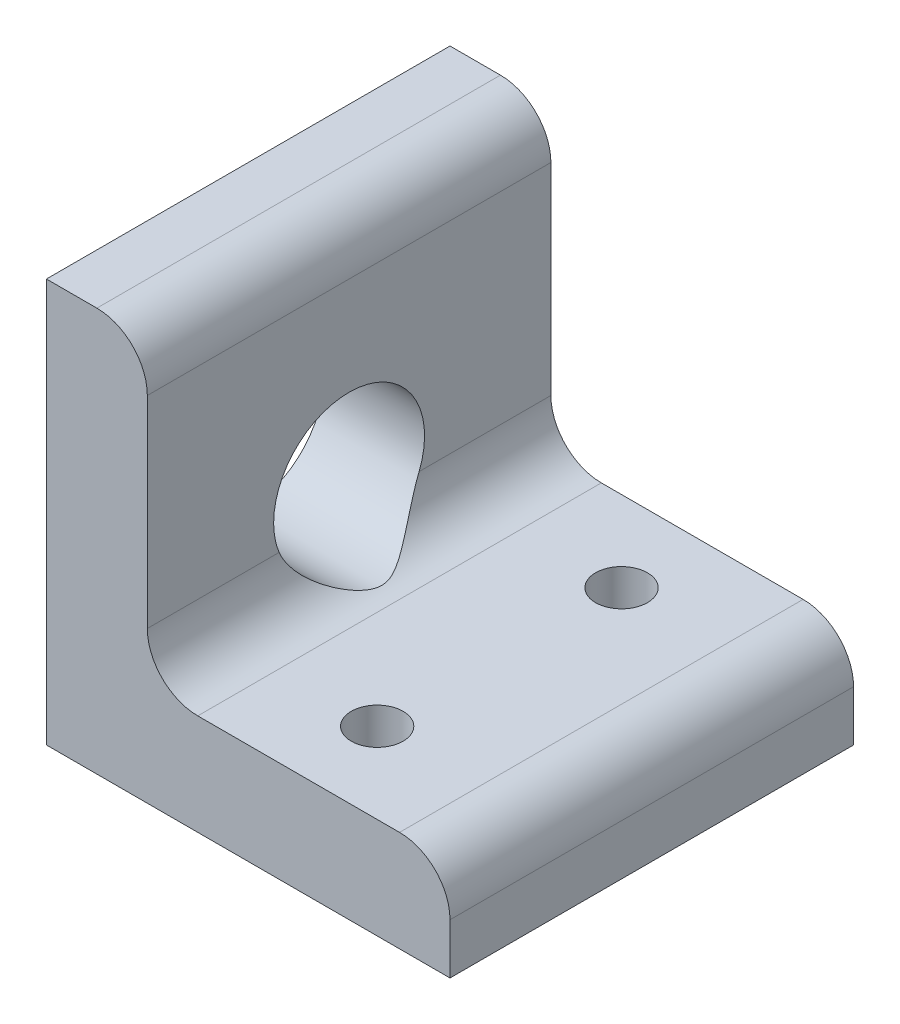
ISO-10303-21;
HEADER;
FILE_DESCRIPTION(('STEP AP214'),'2;1');
FILE_NAME('part.step','',(''),(''),'','','');
FILE_SCHEMA(('AUTOMOTIVE_DESIGN { 1 0 10303 214 1 1 1 1 }'));
ENDSEC;
DATA;
#1=APPLICATION_CONTEXT('core data for automotive mechanical design processes');
#2=APPLICATION_PROTOCOL_DEFINITION('international standard','automotive_design',2000,#1);
#3=PRODUCT_CONTEXT('',#1,'mechanical');
#4=PRODUCT('Part','Part','',(#3));
#5=PRODUCT_RELATED_PRODUCT_CATEGORY('part','',(#4));
#6=PRODUCT_DEFINITION_FORMATION('','',#4);
#7=PRODUCT_DEFINITION_CONTEXT('part definition',#1,'design');
#8=PRODUCT_DEFINITION('design','',#6,#7);
#9=PRODUCT_DEFINITION_SHAPE('','',#8);
#10=(LENGTH_UNIT() NAMED_UNIT(*) SI_UNIT(.MILLI.,.METRE.));
#11=(NAMED_UNIT(*) PLANE_ANGLE_UNIT() SI_UNIT($,.RADIAN.));
#12=(NAMED_UNIT(*) SI_UNIT($,.STERADIAN.) SOLID_ANGLE_UNIT());
#13=UNCERTAINTY_MEASURE_WITH_UNIT(LENGTH_MEASURE(1.E-05),#10,'distance_accuracy_value','');
#14=(GEOMETRIC_REPRESENTATION_CONTEXT(3) GLOBAL_UNCERTAINTY_ASSIGNED_CONTEXT((#13)) GLOBAL_UNIT_ASSIGNED_CONTEXT((#10,
#11,#12)) REPRESENTATION_CONTEXT('',''));
#15=CARTESIAN_POINT('',(0.,0.,0.));
#16=DIRECTION('',(0.,0.,1.));
#17=DIRECTION('',(1.,0.,0.));
#18=AXIS2_PLACEMENT_3D('',#15,#16,#17);
#19=CARTESIAN_POINT('',(6.34999999999999,0.,25.4));
#20=DIRECTION('',(1.,0.,0.));
#21=DIRECTION('',(0.,1.,0.));
#22=AXIS2_PLACEMENT_3D('',#19,#20,#21);
#23=PLANE('',#22);
#24=CARTESIAN_POINT('',(6.34999999999999,11.303,12.7));
#25=DIRECTION('',(1.,0.,0.));
#26=DIRECTION('',(0.,1.,0.));
#27=AXIS2_PLACEMENT_3D('',#24,#25,#26);
#28=CIRCLE('',#27,4.7498);
#29=CARTESIAN_POINT('',(6.34999999999999,9.525,8.29553453413471));
#30=VERTEX_POINT('',#29);
#31=CARTESIAN_POINT('',(6.34999999999999,9.525,17.1044654658653));
#32=VERTEX_POINT('',#31);
#33=EDGE_CURVE('E60',#30,#32,#28,.T.);
#34=ORIENTED_EDGE('',*,*,#33,.F.);
#35=DIRECTION('',(0.,0.,-1.));
#36=VECTOR('',#35,1.);
#37=CARTESIAN_POINT('',(6.34999999999999,9.525,25.4));
#38=LINE('',#37,#36);
#39=CARTESIAN_POINT('',(6.34999999999999,9.525,0.));
#40=VERTEX_POINT('',#39);
#41=EDGE_CURVE('E129',#30,#40,#38,.T.);
#42=ORIENTED_EDGE('',*,*,#41,.T.);
#43=DIRECTION('',(0.,-1.,0.));
#44=VECTOR('',#43,1.);
#45=CARTESIAN_POINT('',(6.34999999999999,0.,0.));
#46=LINE('',#45,#44);
#47=CARTESIAN_POINT('',(6.34999999999999,22.225,0.));
#48=VERTEX_POINT('',#47);
#49=EDGE_CURVE('E177',#48,#40,#46,.T.);
#50=ORIENTED_EDGE('',*,*,#49,.F.);
#51=DIRECTION('',(0.,0.,-1.));
#52=VECTOR('',#51,1.);
#53=CARTESIAN_POINT('',(6.34999999999999,22.225,25.4));
#54=LINE('',#53,#52);
#55=CARTESIAN_POINT('',(6.34999999999999,22.225,25.4));
#56=VERTEX_POINT('',#55);
#57=EDGE_CURVE('E140',#48,#56,#54,.F.);
#58=ORIENTED_EDGE('',*,*,#57,.T.);
#59=DIRECTION('',(0.,-1.,0.));
#60=VECTOR('',#59,1.);
#61=CARTESIAN_POINT('',(6.34999999999999,0.,25.4));
#62=LINE('',#61,#60);
#63=CARTESIAN_POINT('',(6.34999999999999,9.525,25.4));
#64=VERTEX_POINT('',#63);
#65=EDGE_CURVE('E153',#56,#64,#62,.T.);
#66=ORIENTED_EDGE('',*,*,#65,.T.);
#67=EDGE_CURVE('E132',#64,#32,#38,.T.);
#68=ORIENTED_EDGE('',*,*,#67,.T.);
#69=EDGE_LOOP('',(#34,#42,#50,#58,#66,#68));
#70=FACE_BOUND('',#69,.T.);
#71=ADVANCED_FACE('F41',(#70),#23,.T.);
#72=CARTESIAN_POINT('',(0.,25.4,25.4));
#73=DIRECTION('',(0.,1.,0.));
#74=DIRECTION('',(0.,0.,1.));
#75=AXIS2_PLACEMENT_3D('',#72,#73,#74);
#76=PLANE('',#75);
#77=DIRECTION('',(1.,0.,0.));
#78=VECTOR('',#77,1.);
#79=CARTESIAN_POINT('',(0.,25.4,25.4));
#80=LINE('',#79,#78);
#81=CARTESIAN_POINT('',(0.,25.4,25.4));
#82=VERTEX_POINT('',#81);
#83=CARTESIAN_POINT('',(3.17499999999999,25.4,25.4));
#84=VERTEX_POINT('',#83);
#85=EDGE_CURVE('E157',#82,#84,#80,.T.);
#86=ORIENTED_EDGE('',*,*,#85,.T.);
#87=DIRECTION('',(0.,0.,-1.));
#88=VECTOR('',#87,1.);
#89=CARTESIAN_POINT('',(3.17499999999999,25.4,25.4));
#90=LINE('',#89,#88);
#91=CARTESIAN_POINT('',(3.17499999999999,25.4,0.));
#92=VERTEX_POINT('',#91);
#93=EDGE_CURVE('E142',#84,#92,#90,.T.);
#94=ORIENTED_EDGE('',*,*,#93,.T.);
#95=DIRECTION('',(1.,0.,0.));
#96=VECTOR('',#95,1.);
#97=CARTESIAN_POINT('',(0.,25.4,0.));
#98=LINE('',#97,#96);
#99=CARTESIAN_POINT('',(0.,25.4,0.));
#100=VERTEX_POINT('',#99);
#101=EDGE_CURVE('E179',#100,#92,#98,.T.);
#102=ORIENTED_EDGE('',*,*,#101,.F.);
#103=DIRECTION('',(0.,0.,-1.));
#104=VECTOR('',#103,1.);
#105=CARTESIAN_POINT('',(0.,25.4,25.4));
#106=LINE('',#105,#104);
#107=EDGE_CURVE('E193',#82,#100,#106,.T.);
#108=ORIENTED_EDGE('',*,*,#107,.F.);
#109=EDGE_LOOP('',(#86,#94,#102,#108));
#110=FACE_BOUND('',#109,.T.);
#111=ADVANCED_FACE('F231',(#110),#76,.T.);
#112=CARTESIAN_POINT('',(0.,0.,25.4));
#113=DIRECTION('',(-1.,0.,0.));
#114=DIRECTION('',(0.,0.,1.));
#115=AXIS2_PLACEMENT_3D('',#112,#113,#114);
#116=PLANE('',#115);
#117=CARTESIAN_POINT('',(0.,11.303,12.7));
#118=DIRECTION('',(-1.,0.,0.));
#119=DIRECTION('',(0.,0.,1.));
#120=AXIS2_PLACEMENT_3D('',#117,#118,#119);
#121=CIRCLE('',#120,4.7498);
#122=CARTESIAN_POINT('',(0.,11.303,17.4498));
#123=VERTEX_POINT('',#122);
#124=EDGE_CURVE('E134',#123,#123,#121,.T.);
#125=ORIENTED_EDGE('',*,*,#124,.F.);
#126=EDGE_LOOP('',(#125));
#127=FACE_BOUND('',#126,.T.);
#128=DIRECTION('',(0.,1.,0.));
#129=VECTOR('',#128,1.);
#130=CARTESIAN_POINT('',(0.,0.,0.));
#131=LINE('',#130,#129);
#132=CARTESIAN_POINT('',(0.,0.,0.));
#133=VERTEX_POINT('',#132);
#134=EDGE_CURVE('E182',#133,#100,#131,.T.);
#135=ORIENTED_EDGE('',*,*,#134,.F.);
#136=DIRECTION('',(0.,0.,-1.));
#137=VECTOR('',#136,1.);
#138=CARTESIAN_POINT('',(0.,0.,25.4));
#139=LINE('',#138,#137);
#140=CARTESIAN_POINT('',(0.,0.,25.4));
#141=VERTEX_POINT('',#140);
#142=EDGE_CURVE('E191',#141,#133,#139,.T.);
#143=ORIENTED_EDGE('',*,*,#142,.F.);
#144=DIRECTION('',(0.,1.,0.));
#145=VECTOR('',#144,1.);
#146=CARTESIAN_POINT('',(0.,0.,25.4));
#147=LINE('',#146,#145);
#148=EDGE_CURVE('E160',#141,#82,#147,.T.);
#149=ORIENTED_EDGE('',*,*,#148,.T.);
#150=ORIENTED_EDGE('',*,*,#107,.T.);
#151=EDGE_LOOP('',(#135,#143,#149,#150));
#152=FACE_BOUND('',#151,.T.);
#153=ADVANCED_FACE('F228',(#127,#152),#116,.T.);
#154=CARTESIAN_POINT('',(0.,0.,25.4));
#155=DIRECTION('',(0.,1.,0.));
#156=DIRECTION('',(0.,0.,1.));
#157=AXIS2_PLACEMENT_3D('',#154,#155,#156);
#158=PLANE('',#157);
#159=CARTESIAN_POINT('',(15.7351594072586,0.,20.32));
#160=DIRECTION('',(0.,1.,0.));
#161=DIRECTION('',(0.,0.,1.));
#162=AXIS2_PLACEMENT_3D('',#159,#160,#161);
#163=CIRCLE('',#162,1.63194999999999);
#164=CARTESIAN_POINT('',(15.7351594072586,0.,21.95195));
#165=VERTEX_POINT('',#164);
#166=EDGE_CURVE('E286',#165,#165,#163,.T.);
#167=ORIENTED_EDGE('',*,*,#166,.T.);
#168=EDGE_LOOP('',(#167));
#169=FACE_BOUND('',#168,.T.);
#170=CARTESIAN_POINT('',(15.875,0.,5.08));
#171=DIRECTION('',(0.,1.,0.));
#172=DIRECTION('',(0.,0.,1.));
#173=AXIS2_PLACEMENT_3D('',#170,#171,#172);
#174=CIRCLE('',#173,1.63194999999999);
#175=CARTESIAN_POINT('',(15.875,0.,6.71194999999999));
#176=VERTEX_POINT('',#175);
#177=EDGE_CURVE('E166',#176,#176,#174,.T.);
#178=ORIENTED_EDGE('',*,*,#177,.T.);
#179=EDGE_LOOP('',(#178));
#180=FACE_BOUND('',#179,.T.);
#181=DIRECTION('',(1.,0.,0.));
#182=VECTOR('',#181,1.);
#183=CARTESIAN_POINT('',(0.,0.,0.));
#184=LINE('',#183,#182);
#185=CARTESIAN_POINT('',(25.4,0.,0.));
#186=VERTEX_POINT('',#185);
#187=EDGE_CURVE('E185',#133,#186,#184,.T.);
#188=ORIENTED_EDGE('',*,*,#187,.T.);
#189=DIRECTION('',(0.,0.,-1.));
#190=VECTOR('',#189,1.);
#191=CARTESIAN_POINT('',(25.4,0.,25.4));
#192=LINE('',#191,#190);
#193=CARTESIAN_POINT('',(25.4,0.,25.4));
#194=VERTEX_POINT('',#193);
#195=EDGE_CURVE('E176',#194,#186,#192,.T.);
#196=ORIENTED_EDGE('',*,*,#195,.F.);
#197=DIRECTION('',(1.,0.,0.));
#198=VECTOR('',#197,1.);
#199=CARTESIAN_POINT('',(0.,0.,25.4));
#200=LINE('',#199,#198);
#201=EDGE_CURVE('E171',#141,#194,#200,.T.);
#202=ORIENTED_EDGE('',*,*,#201,.F.);
#203=ORIENTED_EDGE('',*,*,#142,.T.);
#204=EDGE_LOOP('',(#188,#196,#202,#203));
#205=FACE_BOUND('',#204,.T.);
#206=ADVANCED_FACE('F224',(#169,#180,#205),#158,.F.);
#207=CARTESIAN_POINT('',(25.4,0.,25.4));
#208=DIRECTION('',(-1.,0.,0.));
#209=DIRECTION('',(0.,0.,1.));
#210=AXIS2_PLACEMENT_3D('',#207,#208,#209);
#211=PLANE('',#210);
#212=DIRECTION('',(0.,1.,0.));
#213=VECTOR('',#212,1.);
#214=CARTESIAN_POINT('',(25.4,0.,0.));
#215=LINE('',#214,#213);
#216=CARTESIAN_POINT('',(25.4,3.175,0.));
#217=VERTEX_POINT('',#216);
#218=EDGE_CURVE('E163',#186,#217,#215,.T.);
#219=ORIENTED_EDGE('',*,*,#218,.T.);
#220=DIRECTION('',(0.,0.,-1.));
#221=VECTOR('',#220,1.);
#222=CARTESIAN_POINT('',(25.4,3.175,25.4));
#223=LINE('',#222,#221);
#224=CARTESIAN_POINT('',(25.4,3.175,25.4));
#225=VERTEX_POINT('',#224);
#226=EDGE_CURVE('E204',#217,#225,#223,.F.);
#227=ORIENTED_EDGE('',*,*,#226,.T.);
#228=DIRECTION('',(0.,1.,0.));
#229=VECTOR('',#228,1.);
#230=CARTESIAN_POINT('',(25.4,0.,25.4));
#231=LINE('',#230,#229);
#232=EDGE_CURVE('E173',#194,#225,#231,.T.);
#233=ORIENTED_EDGE('',*,*,#232,.F.);
#234=ORIENTED_EDGE('',*,*,#195,.T.);
#235=EDGE_LOOP('',(#219,#227,#233,#234));
#236=FACE_BOUND('',#235,.T.);
#237=ADVANCED_FACE('F220',(#236),#211,.F.);
#238=CARTESIAN_POINT('',(0.,6.34999999999999,25.4));
#239=DIRECTION('',(0.,-1.,0.));
#240=DIRECTION('',(1.,0.,0.));
#241=AXIS2_PLACEMENT_3D('',#238,#239,#240);
#242=PLANE('',#241);
#243=CARTESIAN_POINT('',(15.7351594072586,6.35,20.32));
#244=DIRECTION('',(0.,1.,0.));
#245=DIRECTION('',(0.,0.,1.));
#246=AXIS2_PLACEMENT_3D('',#243,#244,#245);
#247=CIRCLE('',#246,1.63194999999999);
#248=CARTESIAN_POINT('',(15.7351594072586,6.35,21.95195));
#249=VERTEX_POINT('',#248);
#250=EDGE_CURVE('E133',#249,#249,#247,.T.);
#251=ORIENTED_EDGE('',*,*,#250,.F.);
#252=EDGE_LOOP('',(#251));
#253=FACE_BOUND('',#252,.T.);
#254=CARTESIAN_POINT('',(15.875,6.35,5.08));
#255=DIRECTION('',(0.,1.,0.));
#256=DIRECTION('',(0.,0.,1.));
#257=AXIS2_PLACEMENT_3D('',#254,#255,#256);
#258=CIRCLE('',#257,1.63194999999999);
#259=CARTESIAN_POINT('',(15.875,6.35,6.71194999999999));
#260=VERTEX_POINT('',#259);
#261=EDGE_CURVE('E288',#260,#260,#258,.T.);
#262=ORIENTED_EDGE('',*,*,#261,.F.);
#263=EDGE_LOOP('',(#262));
#264=FACE_BOUND('',#263,.T.);
#265=DIRECTION('',(-1.,0.,0.));
#266=VECTOR('',#265,1.);
#267=CARTESIAN_POINT('',(0.,6.34999999999999,25.4));
#268=LINE('',#267,#266);
#269=CARTESIAN_POINT('',(22.225,6.35,25.4));
#270=VERTEX_POINT('',#269);
#271=CARTESIAN_POINT('',(9.52499999999999,6.34999999999999,25.4));
#272=VERTEX_POINT('',#271);
#273=EDGE_CURVE('E155',#270,#272,#268,.T.);
#274=ORIENTED_EDGE('',*,*,#273,.F.);
#275=DIRECTION('',(0.,0.,-1.));
#276=VECTOR('',#275,1.);
#277=CARTESIAN_POINT('',(22.225,6.35,25.4));
#278=LINE('',#277,#276);
#279=CARTESIAN_POINT('',(22.225,6.35,0.));
#280=VERTEX_POINT('',#279);
#281=EDGE_CURVE('E197',#270,#280,#278,.T.);
#282=ORIENTED_EDGE('',*,*,#281,.T.);
#283=DIRECTION('',(-1.,0.,0.));
#284=VECTOR('',#283,1.);
#285=CARTESIAN_POINT('',(0.,6.34999999999999,0.));
#286=LINE('',#285,#284);
#287=CARTESIAN_POINT('',(9.52499999999999,6.34999999999999,0.));
#288=VERTEX_POINT('',#287);
#289=EDGE_CURVE('E158',#280,#288,#286,.T.);
#290=ORIENTED_EDGE('',*,*,#289,.T.);
#291=DIRECTION('',(0.,0.,-1.));
#292=VECTOR('',#291,1.);
#293=CARTESIAN_POINT('',(9.52499999999999,6.34999999999999,25.4));
#294=LINE('',#293,#292);
#295=EDGE_CURVE('E195',#288,#272,#294,.F.);
#296=ORIENTED_EDGE('',*,*,#295,.T.);
#297=EDGE_LOOP('',(#274,#282,#290,#296));
#298=FACE_BOUND('',#297,.T.);
#299=ADVANCED_FACE('F212',(#253,#264,#298),#242,.F.);
#300=CARTESIAN_POINT('',(0.,0.,25.4));
#301=DIRECTION('',(0.,0.,1.));
#302=DIRECTION('',(1.,0.,0.));
#303=AXIS2_PLACEMENT_3D('',#300,#301,#302);
#304=PLANE('',#303);
#305=ORIENTED_EDGE('',*,*,#232,.T.);
#306=CARTESIAN_POINT('',(22.225,3.175,25.4));
#307=DIRECTION('',(0.,0.,1.));
#308=DIRECTION('',(1.,0.,0.));
#309=AXIS2_PLACEMENT_3D('',#306,#307,#308);
#310=CIRCLE('',#309,3.175);
#311=EDGE_CURVE('E143',#225,#270,#310,.T.);
#312=ORIENTED_EDGE('',*,*,#311,.T.);
#313=ORIENTED_EDGE('',*,*,#273,.T.);
#314=CARTESIAN_POINT('',(9.52499999999999,9.525,25.4));
#315=DIRECTION('',(0.,0.,1.));
#316=DIRECTION('',(1.,0.,0.));
#317=AXIS2_PLACEMENT_3D('',#314,#315,#316);
#318=CIRCLE('',#317,3.175);
#319=EDGE_CURVE('E54',#272,#64,#318,.F.);
#320=ORIENTED_EDGE('',*,*,#319,.T.);
#321=ORIENTED_EDGE('',*,*,#65,.F.);
#322=CARTESIAN_POINT('',(3.17499999999999,22.225,25.4));
#323=DIRECTION('',(0.,0.,1.));
#324=DIRECTION('',(1.,0.,0.));
#325=AXIS2_PLACEMENT_3D('',#322,#323,#324);
#326=CIRCLE('',#325,3.175);
#327=EDGE_CURVE('E67',#56,#84,#326,.T.);
#328=ORIENTED_EDGE('',*,*,#327,.T.);
#329=ORIENTED_EDGE('',*,*,#85,.F.);
#330=ORIENTED_EDGE('',*,*,#148,.F.);
#331=ORIENTED_EDGE('',*,*,#201,.T.);
#332=EDGE_LOOP('',(#305,#312,#313,#320,#321,#328,#329,#330,#331));
#333=FACE_BOUND('',#332,.T.);
#334=ADVANCED_FACE('F152',(#333),#304,.T.);
#335=CARTESIAN_POINT('',(0.,0.,0.));
#336=DIRECTION('',(0.,0.,1.));
#337=DIRECTION('',(1.,0.,0.));
#338=AXIS2_PLACEMENT_3D('',#335,#336,#337);
#339=PLANE('',#338);
#340=ORIENTED_EDGE('',*,*,#289,.F.);
#341=CARTESIAN_POINT('',(22.225,3.175,0.));
#342=DIRECTION('',(0.,0.,1.));
#343=DIRECTION('',(1.,0.,0.));
#344=AXIS2_PLACEMENT_3D('',#341,#342,#343);
#345=CIRCLE('',#344,3.175);
#346=EDGE_CURVE('E202',#280,#217,#345,.F.);
#347=ORIENTED_EDGE('',*,*,#346,.T.);
#348=ORIENTED_EDGE('',*,*,#218,.F.);
#349=ORIENTED_EDGE('',*,*,#187,.F.);
#350=ORIENTED_EDGE('',*,*,#134,.T.);
#351=ORIENTED_EDGE('',*,*,#101,.T.);
#352=CARTESIAN_POINT('',(3.17499999999999,22.225,0.));
#353=DIRECTION('',(0.,0.,1.));
#354=DIRECTION('',(1.,0.,0.));
#355=AXIS2_PLACEMENT_3D('',#352,#353,#354);
#356=CIRCLE('',#355,3.175);
#357=EDGE_CURVE('E200',#92,#48,#356,.F.);
#358=ORIENTED_EDGE('',*,*,#357,.T.);
#359=ORIENTED_EDGE('',*,*,#49,.T.);
#360=CARTESIAN_POINT('',(9.52499999999999,9.525,0.));
#361=DIRECTION('',(0.,0.,1.));
#362=DIRECTION('',(1.,0.,0.));
#363=AXIS2_PLACEMENT_3D('',#360,#361,#362);
#364=CIRCLE('',#363,3.175);
#365=EDGE_CURVE('E138',#40,#288,#364,.T.);
#366=ORIENTED_EDGE('',*,*,#365,.T.);
#367=EDGE_LOOP('',(#340,#347,#348,#349,#350,#351,#358,#359,#366));
#368=FACE_BOUND('',#367,.T.);
#369=ADVANCED_FACE('F217',(#368),#339,.F.);
#370=CARTESIAN_POINT('',(15.875,6.35,5.08));
#371=DIRECTION('',(0.,1.,0.));
#372=DIRECTION('',(0.,0.,1.));
#373=AXIS2_PLACEMENT_3D('',#370,#371,#372);
#374=CYLINDRICAL_SURFACE('',#373,1.63194999999999);
#375=ORIENTED_EDGE('',*,*,#177,.F.);
#376=EDGE_LOOP('',(#375));
#377=FACE_BOUND('',#376,.T.);
#378=ORIENTED_EDGE('',*,*,#261,.T.);
#379=EDGE_LOOP('',(#378));
#380=FACE_BOUND('',#379,.T.);
#381=ADVANCED_FACE('F253',(#377,#380),#374,.F.);
#382=CARTESIAN_POINT('',(15.7351594072586,6.35,20.32));
#383=DIRECTION('',(0.,1.,0.));
#384=DIRECTION('',(0.,0.,1.));
#385=AXIS2_PLACEMENT_3D('',#382,#383,#384);
#386=CYLINDRICAL_SURFACE('',#385,1.63194999999999);
#387=ORIENTED_EDGE('',*,*,#166,.F.);
#388=EDGE_LOOP('',(#387));
#389=FACE_BOUND('',#388,.T.);
#390=ORIENTED_EDGE('',*,*,#250,.T.);
#391=EDGE_LOOP('',(#390));
#392=FACE_BOUND('',#391,.T.);
#393=ADVANCED_FACE('F248',(#389,#392),#386,.F.);
#394=CARTESIAN_POINT('',(22.225,3.175,25.4));
#395=DIRECTION('',(0.,0.,-1.));
#396=DIRECTION('',(-1.,0.,0.));
#397=AXIS2_PLACEMENT_3D('',#394,#395,#396);
#398=CYLINDRICAL_SURFACE('',#397,3.175);
#399=ORIENTED_EDGE('',*,*,#311,.F.);
#400=ORIENTED_EDGE('',*,*,#226,.F.);
#401=ORIENTED_EDGE('',*,*,#346,.F.);
#402=ORIENTED_EDGE('',*,*,#281,.F.);
#403=EDGE_LOOP('',(#399,#400,#401,#402));
#404=FACE_BOUND('',#403,.T.);
#405=ADVANCED_FACE('F214',(#404),#398,.T.);
#406=CARTESIAN_POINT('',(9.52499999999999,9.525,25.4));
#407=DIRECTION('',(0.,0.,-1.));
#408=DIRECTION('',(-1.,0.,0.));
#409=AXIS2_PLACEMENT_3D('',#406,#407,#408);
#410=CYLINDRICAL_SURFACE('',#409,3.175);
#411=ORIENTED_EDGE('',*,*,#41,.F.);
#412=CARTESIAN_POINT('',(6.34999999999999,9.525,8.29553453413471));
#413=CARTESIAN_POINT('',(6.34998732580468,9.4343525372501,8.33210225539424));
#414=CARTESIAN_POINT('',(6.35388031550771,9.34490710962071,8.3714872334758));
#415=CARTESIAN_POINT('',(6.36877100559021,9.1692208890903,8.45535792676236));
#416=CARTESIAN_POINT('',(6.37975708702125,9.08297509885365,8.49983520260564));
#417=CARTESIAN_POINT('',(6.4079814447648,8.91508292338816,8.59298287338225));
#418=CARTESIAN_POINT('',(6.42515220285895,8.83339747053282,8.64160381542594));
#419=CARTESIAN_POINT('',(6.46506427456516,8.6740180233898,8.74298376873904));
#420=CARTESIAN_POINT('',(6.48780838689056,8.59632605825657,8.79574484994237));
#421=CARTESIAN_POINT('',(6.54445487935007,8.4264253338551,8.91853645899226));
#422=CARTESIAN_POINT('',(6.5797255372121,8.33541494563789,8.98959730147341));
#423=CARTESIAN_POINT('',(6.65664785210971,8.16032476066487,9.13667467709899));
#424=CARTESIAN_POINT('',(6.69830414564092,8.07625006857316,9.21269478785374));
#425=CARTESIAN_POINT('',(6.83153179314908,7.83386662970235,9.4478440394921));
#426=CARTESIAN_POINT('',(6.93109696862093,7.68614151792837,9.61351587726584));
#427=CARTESIAN_POINT('',(7.11005096145462,7.46043317421076,9.90396993603976));
#428=CARTESIAN_POINT('',(7.18602134544124,7.37508209131789,10.025350700301));
#429=CARTESIAN_POINT('',(7.3419232769596,7.21694582034926,10.2738011822279));
#430=CARTESIAN_POINT('',(7.42185726178022,7.14416849057836,10.4008743955253));
#431=CARTESIAN_POINT('',(7.5830863247675,7.01093430771693,10.6603773250129));
#432=CARTESIAN_POINT('',(7.6643809041234,6.95047304202481,10.7928051023164));
#433=CARTESIAN_POINT('',(7.82512683666294,6.84163812848291,11.0635013653357));
#434=CARTESIAN_POINT('',(7.90457967883476,6.79325438346274,11.2017648583794));
#435=CARTESIAN_POINT('',(8.04783612069051,6.71349987181394,11.4694243150834));
#436=CARTESIAN_POINT('',(8.11238974669367,6.68081505779296,11.5980214638373));
#437=CARTESIAN_POINT('',(8.22942305861383,6.6256474995888,11.8626477637801));
#438=CARTESIAN_POINT('',(8.28193839945438,6.60313443129918,11.9986534516993));
#439=CARTESIAN_POINT('',(8.35115432997364,6.57479632105071,12.2369755504062));
#440=CARTESIAN_POINT('',(8.37387864320736,6.56598682350854,12.3370937398411));
#441=CARTESIAN_POINT('',(8.40297434837419,6.55482246615199,12.5398787290727));
#442=CARTESIAN_POINT('',(8.40940171713319,6.55244550991364,12.6425355785526));
#443=CARTESIAN_POINT('',(8.40426563732284,6.55438056716894,12.8474366258136));
#444=CARTESIAN_POINT('',(8.39267665154309,6.55870207534885,12.9496800315198));
#445=CARTESIAN_POINT('',(8.35448099256391,6.57357734937383,13.1510475675744));
#446=CARTESIAN_POINT('',(8.3278156402802,6.58415547420955,13.2501579024468));
#447=CARTESIAN_POINT('',(8.26584673509608,6.61017130775011,13.4393493809286));
#448=CARTESIAN_POINT('',(8.23103046412079,6.62534550579819,13.5296349918108));
#449=CARTESIAN_POINT('',(8.15547096820318,6.66025726761605,13.7068278330386));
#450=CARTESIAN_POINT('',(8.11472143110779,6.67999970469044,13.7937313389402));
#451=CARTESIAN_POINT('',(8.02946497127131,6.72387353561646,13.9649257705914));
#452=CARTESIAN_POINT('',(7.98494463098235,6.74802098807343,14.0492057711805));
#453=CARTESIAN_POINT('',(7.89381605186737,6.80054818008375,14.2152918956961));
#454=CARTESIAN_POINT('',(7.84720723505369,6.82892909637639,14.2970973241588));
#455=CARTESIAN_POINT('',(7.7187118615374,6.91208530569809,14.5173429457542));
#456=CARTESIAN_POINT('',(7.63584563875055,6.97103399793216,14.6536565263488));
#457=CARTESIAN_POINT('',(7.47093935097467,7.10166196946857,14.920684430474));
#458=CARTESIAN_POINT('',(7.38889984615886,7.17334933812228,15.051395130193));
#459=CARTESIAN_POINT('',(7.22858958979412,7.32963513912409,15.306783947288));
#460=CARTESIAN_POINT('',(7.15031008917247,7.41420147727372,15.4314760728234));
#461=CARTESIAN_POINT('',(6.99984637465997,7.59673510081976,15.6744341796692));
#462=CARTESIAN_POINT('',(6.92765750402235,7.69469199517976,15.7927050453933));
#463=CARTESIAN_POINT('',(6.7768268847361,7.92766502828251,16.0471955019221));
#464=CARTESIAN_POINT('',(6.70029305919747,8.06608492157991,16.1815941894057));
#465=CARTESIAN_POINT('',(6.56570743523816,8.36325664877001,16.4358355688422));
#466=CARTESIAN_POINT('',(6.50759051581975,8.52193399608979,16.5557286004132));
#467=CARTESIAN_POINT('',(6.44422410667226,8.75433872372349,16.708854559524));
#468=CARTESIAN_POINT('',(6.42846315895124,8.8201720294123,16.7499692523863));
#469=CARTESIAN_POINT('',(6.40094472181657,8.95439326461405,16.829250688921));
#470=CARTESIAN_POINT('',(6.38918587923743,9.02278032197317,16.8674184256176));
#471=CARTESIAN_POINT('',(6.3699916087747,9.16231950812762,16.9407943481079));
#472=CARTESIAN_POINT('',(6.36258579169001,9.2334871408419,16.9759809016358));
#473=CARTESIAN_POINT('',(6.35258459494327,9.37784009106296,17.0428931369335));
#474=CARTESIAN_POINT('',(6.34999384205271,9.4510272807101,17.0746154624297));
#475=CARTESIAN_POINT('',(6.34999999999999,9.525,17.1044654658653));
#476=B_SPLINE_CURVE_WITH_KNOTS('',3,(#412,#413,#414,#415,#416,#417,#418,#419,#420,#421,#422,
#423,#424,#425,#426,#427,#428,#429,#430,#431,#432,#433,#434,#435,#436,#437,#438,#439,#440,#441,
#442,#443,#444,#445,#446,#447,#448,#449,#450,#451,#452,#453,#454,#455,#456,#457,#458,#459,#460,
#461,#462,#463,#464,#465,#466,#467,#468,#469,#470,#471,#472,#473,#474,#475),.UNSPECIFIED.,.F.,
.F.,(4,2,2,2,2,2,2,2,2,2,2,2,2,2,2,2,2,2,2,2,2,2,2,2,2,2,2,2,2,2,2,4),(0.,0.293022659335609,
0.585566541997809,0.87500898330011,1.16459706983049,1.52624552527256,1.88815782193079,
2.6148256360866,3.1144031294487,3.61429172654319,4.11400090722736,4.61329090616077,
5.05537983797656,5.49614197014187,5.8040844449427,6.11096775568265,6.41828645372834,
6.72680959052245,7.02021546149114,7.31393578678237,7.60874909025884,7.90364449366899,
8.41322919322177,8.92313865474058,9.43179761587332,9.94006407629702,10.5608216573541,
11.1793591335743,11.4168093655101,11.654179232389,11.89314562529,12.1323415213412),.UNSPECIFIED.);
#477=EDGE_CURVE('E11',#30,#32,#476,.T.);
#478=ORIENTED_EDGE('',*,*,#477,.T.);
#479=ORIENTED_EDGE('',*,*,#67,.F.);
#480=ORIENTED_EDGE('',*,*,#319,.F.);
#481=ORIENTED_EDGE('',*,*,#295,.F.);
#482=ORIENTED_EDGE('',*,*,#365,.F.);
#483=EDGE_LOOP('',(#411,#478,#479,#480,#481,#482));
#484=FACE_BOUND('',#483,.T.);
#485=ADVANCED_FACE('F136',(#484),#410,.F.);
#486=CARTESIAN_POINT('',(3.17499999999999,22.225,25.4));
#487=DIRECTION('',(0.,0.,-1.));
#488=DIRECTION('',(-1.,0.,0.));
#489=AXIS2_PLACEMENT_3D('',#486,#487,#488);
#490=CYLINDRICAL_SURFACE('',#489,3.175);
#491=ORIENTED_EDGE('',*,*,#327,.F.);
#492=ORIENTED_EDGE('',*,*,#57,.F.);
#493=ORIENTED_EDGE('',*,*,#357,.F.);
#494=ORIENTED_EDGE('',*,*,#93,.F.);
#495=EDGE_LOOP('',(#491,#492,#493,#494));
#496=FACE_BOUND('',#495,.T.);
#497=ADVANCED_FACE('F43',(#496),#490,.T.);
#498=CARTESIAN_POINT('',(0.,11.303,12.7));
#499=DIRECTION('',(-1.,0.,0.));
#500=DIRECTION('',(0.,0.,1.));
#501=AXIS2_PLACEMENT_3D('',#498,#499,#500);
#502=CYLINDRICAL_SURFACE('',#501,4.7498);
#503=ORIENTED_EDGE('',*,*,#33,.T.);
#504=ORIENTED_EDGE('',*,*,#477,.F.);
#505=EDGE_LOOP('',(#503,#504));
#506=FACE_BOUND('',#505,.T.);
#507=ORIENTED_EDGE('',*,*,#124,.T.);
#508=EDGE_LOOP('',(#507));
#509=FACE_BOUND('',#508,.T.);
#510=ADVANCED_FACE('F121',(#506,#509),#502,.F.);
#511=CLOSED_SHELL('',(#71,#111,#153,#206,#237,#299,#334,#369,#381,#393,#405,#485,#497,#510));
#512=MANIFOLD_SOLID_BREP('B2',#511);
#513=ADVANCED_BREP_SHAPE_REPRESENTATION('',(#18,#512),#14);
#514=SHAPE_DEFINITION_REPRESENTATION(#9,#513);
ENDSEC;
END-ISO-10303-21;
